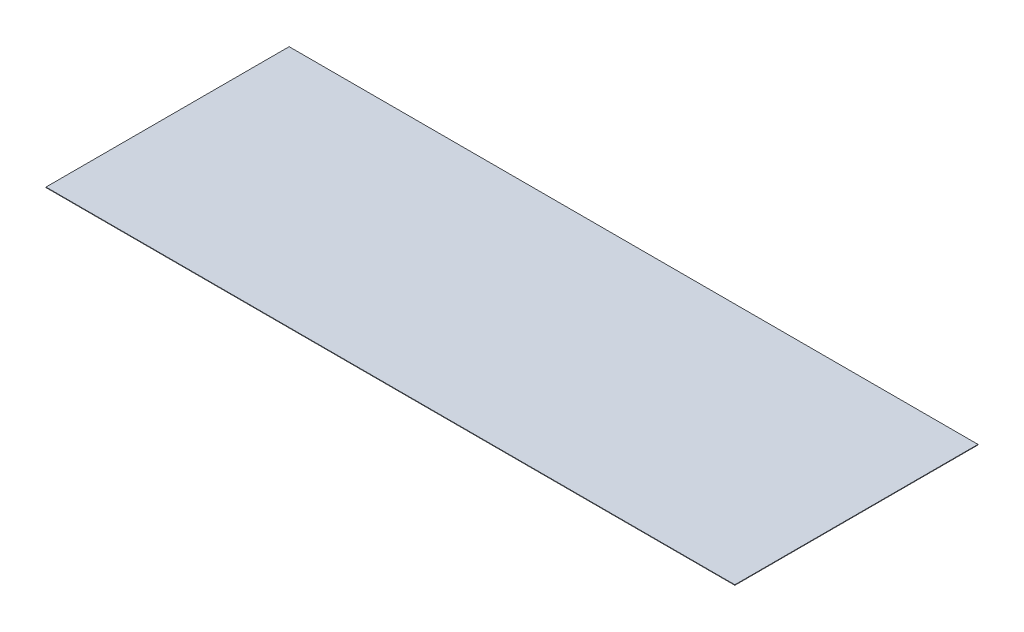
ISO-10303-21;
HEADER;
FILE_DESCRIPTION(('STEP AP214'),'2;1');
FILE_NAME('part.step','',(''),(''),'','','');
FILE_SCHEMA(('AUTOMOTIVE_DESIGN { 1 0 10303 214 1 1 1 1 }'));
ENDSEC;
DATA;
#1=APPLICATION_CONTEXT('core data for automotive mechanical design processes');
#2=APPLICATION_PROTOCOL_DEFINITION('international standard','automotive_design',2000,#1);
#3=PRODUCT_CONTEXT('',#1,'mechanical');
#4=PRODUCT('Part','Part','',(#3));
#5=PRODUCT_RELATED_PRODUCT_CATEGORY('part','',(#4));
#6=PRODUCT_DEFINITION_FORMATION('','',#4);
#7=PRODUCT_DEFINITION_CONTEXT('part definition',#1,'design');
#8=PRODUCT_DEFINITION('design','',#6,#7);
#9=PRODUCT_DEFINITION_SHAPE('','',#8);
#10=(LENGTH_UNIT() NAMED_UNIT(*) SI_UNIT(.MILLI.,.METRE.));
#11=(NAMED_UNIT(*) PLANE_ANGLE_UNIT() SI_UNIT($,.RADIAN.));
#12=(NAMED_UNIT(*) SI_UNIT($,.STERADIAN.) SOLID_ANGLE_UNIT());
#13=UNCERTAINTY_MEASURE_WITH_UNIT(LENGTH_MEASURE(1.E-05),#10,'distance_accuracy_value','');
#14=(GEOMETRIC_REPRESENTATION_CONTEXT(3) GLOBAL_UNCERTAINTY_ASSIGNED_CONTEXT((#13)) GLOBAL_UNIT_ASSIGNED_CONTEXT((#10,
#11,#12)) REPRESENTATION_CONTEXT('',''));
#15=CARTESIAN_POINT('',(0.,0.,0.));
#16=DIRECTION('',(0.,0.,1.));
#17=DIRECTION('',(1.,0.,0.));
#18=AXIS2_PLACEMENT_3D('',#15,#16,#17);
#19=CARTESIAN_POINT('',(26.67,0.00149999999999997,0.));
#20=DIRECTION('',(0.,1.,0.));
#21=DIRECTION('',(0.,0.,1.));
#22=AXIS2_PLACEMENT_3D('',#19,#20,#21);
#23=PLANE('',#22);
#24=DIRECTION('',(0.,0.,1.));
#25=VECTOR('',#24,1.);
#26=CARTESIAN_POINT('',(18.0637147096166,0.00149999999999997,0.));
#27=LINE('',#26,#25);
#28=CARTESIAN_POINT('',(18.0637147096166,0.00149999999999997,-87.8126575445702));
#29=VERTEX_POINT('',#28);
#30=CARTESIAN_POINT('',(18.0637147096166,0.00149999999999997,-88.5411977013446));
#31=VERTEX_POINT('',#30);
#32=EDGE_CURVE('E80',#29,#31,#27,.F.);
#33=ORIENTED_EDGE('',*,*,#32,.T.);
#34=DIRECTION('',(1.,0.,0.));
#35=VECTOR('',#34,1.);
#36=CARTESIAN_POINT('',(26.67,0.00149999999999997,-88.5411977013446));
#37=LINE('',#36,#35);
#38=CARTESIAN_POINT('',(15.9995175987559,0.00149999999999997,-88.5411977013446));
#39=VERTEX_POINT('',#38);
#40=EDGE_CURVE('E66',#31,#39,#37,.F.);
#41=ORIENTED_EDGE('',*,*,#40,.T.);
#42=DIRECTION('',(0.,0.,1.));
#43=VECTOR('',#42,1.);
#44=CARTESIAN_POINT('',(15.9995175987559,0.00149999999999997,0.));
#45=LINE('',#44,#43);
#46=CARTESIAN_POINT('',(15.9995175987559,0.00149999999999997,-87.8126575445702));
#47=VERTEX_POINT('',#46);
#48=EDGE_CURVE('E62',#39,#47,#45,.T.);
#49=ORIENTED_EDGE('',*,*,#48,.T.);
#50=DIRECTION('',(1.,0.,0.));
#51=VECTOR('',#50,1.);
#52=CARTESIAN_POINT('',(26.67,0.00149999999999997,-87.8126575445702));
#53=LINE('',#52,#51);
#54=EDGE_CURVE('E64',#29,#47,#53,.F.);
#55=ORIENTED_EDGE('',*,*,#54,.F.);
#56=EDGE_LOOP('',(#33,#41,#49,#55));
#57=FACE_BOUND('',#56,.T.);
#58=ADVANCED_FACE('F16',(#57),#23,.T.);
#59=CARTESIAN_POINT('',(26.67,0.,-87.8126575445702));
#60=DIRECTION('',(0.,0.,1.));
#61=DIRECTION('',(1.,0.,0.));
#62=AXIS2_PLACEMENT_3D('',#59,#60,#61);
#63=PLANE('',#62);
#64=DIRECTION('',(1.,0.,0.));
#65=VECTOR('',#64,1.);
#66=CARTESIAN_POINT('',(26.67,0.,-87.8126575445702));
#67=LINE('',#66,#65);
#68=CARTESIAN_POINT('',(15.9995175987559,0.,-87.8126575445702));
#69=VERTEX_POINT('',#68);
#70=CARTESIAN_POINT('',(18.0637147096166,0.,-87.8126575445702));
#71=VERTEX_POINT('',#70);
#72=EDGE_CURVE('E56',#69,#71,#67,.T.);
#73=ORIENTED_EDGE('',*,*,#72,.T.);
#74=DIRECTION('',(0.,1.,0.));
#75=VECTOR('',#74,1.);
#76=CARTESIAN_POINT('',(18.0637147096166,0.,-87.8126575445702));
#77=LINE('',#76,#75);
#78=EDGE_CURVE('E19',#71,#29,#77,.T.);
#79=ORIENTED_EDGE('',*,*,#78,.T.);
#80=ORIENTED_EDGE('',*,*,#54,.T.);
#81=DIRECTION('',(0.,1.,0.));
#82=VECTOR('',#81,1.);
#83=CARTESIAN_POINT('',(15.9995175987559,0.,-87.8126575445702));
#84=LINE('',#83,#82);
#85=EDGE_CURVE('E71',#69,#47,#84,.T.);
#86=ORIENTED_EDGE('',*,*,#85,.F.);
#87=EDGE_LOOP('',(#73,#79,#80,#86));
#88=FACE_BOUND('',#87,.T.);
#89=ADVANCED_FACE('F70',(#88),#63,.T.);
#90=CARTESIAN_POINT('',(18.0637147096166,0.,0.));
#91=DIRECTION('',(-1.,0.,0.));
#92=DIRECTION('',(0.,0.,1.));
#93=AXIS2_PLACEMENT_3D('',#90,#91,#92);
#94=PLANE('',#93);
#95=ORIENTED_EDGE('',*,*,#78,.F.);
#96=DIRECTION('',(0.,0.,1.));
#97=VECTOR('',#96,1.);
#98=CARTESIAN_POINT('',(18.0637147096166,0.,0.));
#99=LINE('',#98,#97);
#100=CARTESIAN_POINT('',(18.0637147096166,0.,-88.5411977013446));
#101=VERTEX_POINT('',#100);
#102=EDGE_CURVE('E75',#71,#101,#99,.F.);
#103=ORIENTED_EDGE('',*,*,#102,.T.);
#104=DIRECTION('',(0.,1.,0.));
#105=VECTOR('',#104,1.);
#106=CARTESIAN_POINT('',(18.0637147096166,0.,-88.5411977013446));
#107=LINE('',#106,#105);
#108=EDGE_CURVE('E78',#101,#31,#107,.T.);
#109=ORIENTED_EDGE('',*,*,#108,.T.);
#110=ORIENTED_EDGE('',*,*,#32,.F.);
#111=EDGE_LOOP('',(#95,#103,#109,#110));
#112=FACE_BOUND('',#111,.T.);
#113=ADVANCED_FACE('F90',(#112),#94,.F.);
#114=CARTESIAN_POINT('',(26.67,0.,-88.5411977013446));
#115=DIRECTION('',(0.,0.,1.));
#116=DIRECTION('',(1.,0.,0.));
#117=AXIS2_PLACEMENT_3D('',#114,#115,#116);
#118=PLANE('',#117);
#119=ORIENTED_EDGE('',*,*,#108,.F.);
#120=DIRECTION('',(1.,0.,0.));
#121=VECTOR('',#120,1.);
#122=CARTESIAN_POINT('',(26.67,0.,-88.5411977013446));
#123=LINE('',#122,#121);
#124=CARTESIAN_POINT('',(15.9995175987559,0.,-88.5411977013446));
#125=VERTEX_POINT('',#124);
#126=EDGE_CURVE('E25',#101,#125,#123,.F.);
#127=ORIENTED_EDGE('',*,*,#126,.T.);
#128=DIRECTION('',(0.,1.,0.));
#129=VECTOR('',#128,1.);
#130=CARTESIAN_POINT('',(15.9995175987559,0.,-88.5411977013446));
#131=LINE('',#130,#129);
#132=EDGE_CURVE('E33',#39,#125,#131,.F.);
#133=ORIENTED_EDGE('',*,*,#132,.F.);
#134=ORIENTED_EDGE('',*,*,#40,.F.);
#135=EDGE_LOOP('',(#119,#127,#133,#134));
#136=FACE_BOUND('',#135,.T.);
#137=ADVANCED_FACE('F88',(#136),#118,.F.);
#138=CARTESIAN_POINT('',(15.9995175987559,0.,0.));
#139=DIRECTION('',(-1.,0.,0.));
#140=DIRECTION('',(0.,0.,1.));
#141=AXIS2_PLACEMENT_3D('',#138,#139,#140);
#142=PLANE('',#141);
#143=DIRECTION('',(0.,0.,1.));
#144=VECTOR('',#143,1.);
#145=CARTESIAN_POINT('',(15.9995175987559,0.,0.));
#146=LINE('',#145,#144);
#147=EDGE_CURVE('E11',#125,#69,#146,.T.);
#148=ORIENTED_EDGE('',*,*,#147,.T.);
#149=ORIENTED_EDGE('',*,*,#85,.T.);
#150=ORIENTED_EDGE('',*,*,#48,.F.);
#151=ORIENTED_EDGE('',*,*,#132,.T.);
#152=EDGE_LOOP('',(#148,#149,#150,#151));
#153=FACE_BOUND('',#152,.T.);
#154=ADVANCED_FACE('F73',(#153),#142,.T.);
#155=CARTESIAN_POINT('',(26.67,0.,0.));
#156=DIRECTION('',(0.,1.,0.));
#157=DIRECTION('',(0.,0.,1.));
#158=AXIS2_PLACEMENT_3D('',#155,#156,#157);
#159=PLANE('',#158);
#160=ORIENTED_EDGE('',*,*,#126,.F.);
#161=ORIENTED_EDGE('',*,*,#102,.F.);
#162=ORIENTED_EDGE('',*,*,#72,.F.);
#163=ORIENTED_EDGE('',*,*,#147,.F.);
#164=EDGE_LOOP('',(#160,#161,#162,#163));
#165=FACE_BOUND('',#164,.T.);
#166=ADVANCED_FACE('F89',(#165),#159,.F.);
#167=CLOSED_SHELL('',(#58,#89,#113,#137,#154,#166));
#168=MANIFOLD_SOLID_BREP('B1',#167);
#169=ADVANCED_BREP_SHAPE_REPRESENTATION('',(#18,#168),#14);
#170=SHAPE_DEFINITION_REPRESENTATION(#9,#169);
ENDSEC;
END-ISO-10303-21;
